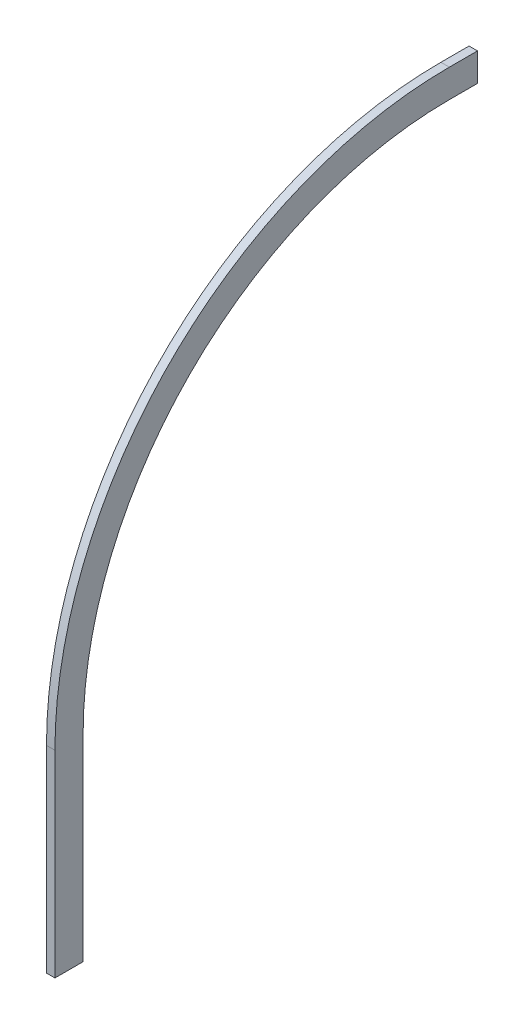
ISO-10303-21;
HEADER;
FILE_DESCRIPTION(('STEP AP214'),'2;1');
FILE_NAME('part.step','',(''),(''),'','','');
FILE_SCHEMA(('AUTOMOTIVE_DESIGN { 1 0 10303 214 1 1 1 1 }'));
ENDSEC;
DATA;
#1=APPLICATION_CONTEXT('core data for automotive mechanical design processes');
#2=APPLICATION_PROTOCOL_DEFINITION('international standard','automotive_design',2000,#1);
#3=PRODUCT_CONTEXT('',#1,'mechanical');
#4=PRODUCT('Part','Part','',(#3));
#5=PRODUCT_RELATED_PRODUCT_CATEGORY('part','',(#4));
#6=PRODUCT_DEFINITION_FORMATION('','',#4);
#7=PRODUCT_DEFINITION_CONTEXT('part definition',#1,'design');
#8=PRODUCT_DEFINITION('design','',#6,#7);
#9=PRODUCT_DEFINITION_SHAPE('','',#8);
#10=(LENGTH_UNIT() NAMED_UNIT(*) SI_UNIT(.MILLI.,.METRE.));
#11=(NAMED_UNIT(*) PLANE_ANGLE_UNIT() SI_UNIT($,.RADIAN.));
#12=(NAMED_UNIT(*) SI_UNIT($,.STERADIAN.) SOLID_ANGLE_UNIT());
#13=UNCERTAINTY_MEASURE_WITH_UNIT(LENGTH_MEASURE(1.E-05),#10,'distance_accuracy_value','');
#14=(GEOMETRIC_REPRESENTATION_CONTEXT(3) GLOBAL_UNCERTAINTY_ASSIGNED_CONTEXT((#13)) GLOBAL_UNIT_ASSIGNED_CONTEXT((#10,
#11,#12)) REPRESENTATION_CONTEXT('',''));
#15=CARTESIAN_POINT('',(0.,0.,0.));
#16=DIRECTION('',(0.,0.,1.));
#17=DIRECTION('',(1.,0.,0.));
#18=AXIS2_PLACEMENT_3D('',#15,#16,#17);
#19=CARTESIAN_POINT('',(3.,0.,0.));
#20=DIRECTION('',(0.,1.,0.));
#21=DIRECTION('',(0.,0.,1.));
#22=AXIS2_PLACEMENT_3D('',#19,#20,#21);
#23=PLANE('',#22);
#24=DIRECTION('',(0.,0.,-1.));
#25=VECTOR('',#24,1.);
#26=CARTESIAN_POINT('',(0.,0.,0.));
#27=LINE('',#26,#25);
#28=CARTESIAN_POINT('',(0.,0.,10.));
#29=VERTEX_POINT('',#28);
#30=CARTESIAN_POINT('',(0.,0.,0.));
#31=VERTEX_POINT('',#30);
#32=EDGE_CURVE('E134',#29,#31,#27,.T.);
#33=ORIENTED_EDGE('',*,*,#32,.T.);
#34=DIRECTION('',(-1.,0.,0.));
#35=VECTOR('',#34,1.);
#36=CARTESIAN_POINT('',(3.,0.,0.));
#37=LINE('',#36,#35);
#38=CARTESIAN_POINT('',(3.,0.,0.));
#39=VERTEX_POINT('',#38);
#40=EDGE_CURVE('E11',#39,#31,#37,.T.);
#41=ORIENTED_EDGE('',*,*,#40,.F.);
#42=DIRECTION('',(0.,0.,-1.));
#43=VECTOR('',#42,1.);
#44=CARTESIAN_POINT('',(3.,0.,0.));
#45=LINE('',#44,#43);
#46=CARTESIAN_POINT('',(3.,0.,10.));
#47=VERTEX_POINT('',#46);
#48=EDGE_CURVE('E148',#47,#39,#45,.T.);
#49=ORIENTED_EDGE('',*,*,#48,.F.);
#50=DIRECTION('',(-1.,0.,0.));
#51=VECTOR('',#50,1.);
#52=CARTESIAN_POINT('',(3.,0.,10.));
#53=LINE('',#52,#51);
#54=EDGE_CURVE('E130',#47,#29,#53,.T.);
#55=ORIENTED_EDGE('',*,*,#54,.T.);
#56=EDGE_LOOP('',(#33,#41,#49,#55));
#57=FACE_BOUND('',#56,.T.);
#58=ADVANCED_FACE('F38',(#57),#23,.F.);
#59=CARTESIAN_POINT('',(3.,0.,0.));
#60=DIRECTION('',(0.,0.,1.));
#61=DIRECTION('',(0.,-1.,0.));
#62=AXIS2_PLACEMENT_3D('',#59,#60,#61);
#63=PLANE('',#62);
#64=DIRECTION('',(0.,1.,0.));
#65=VECTOR('',#64,1.);
#66=CARTESIAN_POINT('',(0.,0.,0.));
#67=LINE('',#66,#65);
#68=CARTESIAN_POINT('',(0.,69.9999999999991,0.));
#69=VERTEX_POINT('',#68);
#70=EDGE_CURVE('E137',#31,#69,#67,.T.);
#71=ORIENTED_EDGE('',*,*,#70,.T.);
#72=DIRECTION('',(-1.,0.,0.));
#73=VECTOR('',#72,1.);
#74=CARTESIAN_POINT('',(3.,69.9999999999991,0.));
#75=LINE('',#74,#73);
#76=CARTESIAN_POINT('',(3.,69.9999999999991,0.));
#77=VERTEX_POINT('',#76);
#78=EDGE_CURVE('E46',#77,#69,#75,.T.);
#79=ORIENTED_EDGE('',*,*,#78,.F.);
#80=DIRECTION('',(0.,1.,0.));
#81=VECTOR('',#80,1.);
#82=CARTESIAN_POINT('',(3.,0.,0.));
#83=LINE('',#82,#81);
#84=EDGE_CURVE('E97',#39,#77,#83,.T.);
#85=ORIENTED_EDGE('',*,*,#84,.F.);
#86=ORIENTED_EDGE('',*,*,#40,.T.);
#87=EDGE_LOOP('',(#71,#79,#85,#86));
#88=FACE_BOUND('',#87,.T.);
#89=ADVANCED_FACE('F183',(#88),#63,.F.);
#90=CARTESIAN_POINT('',(3.,70.0000000000001,-130.));
#91=DIRECTION('',(-1.,0.,0.));
#92=DIRECTION('',(0.,0.,1.));
#93=AXIS2_PLACEMENT_3D('',#90,#91,#92);
#94=CYLINDRICAL_SURFACE('',#93,130.);
#95=CARTESIAN_POINT('',(0.,70.0000000000001,-130.));
#96=DIRECTION('',(-1.,0.,0.));
#97=DIRECTION('',(0.,0.,-1.));
#98=AXIS2_PLACEMENT_3D('',#95,#96,#97);
#99=CIRCLE('',#98,130.);
#100=CARTESIAN_POINT('',(0.,200.,-130.000000000001));
#101=VERTEX_POINT('',#100);
#102=EDGE_CURVE('E139',#69,#101,#99,.T.);
#103=ORIENTED_EDGE('',*,*,#102,.T.);
#104=DIRECTION('',(-1.,0.,0.));
#105=VECTOR('',#104,1.);
#106=CARTESIAN_POINT('',(3.,200.,-130.000000000001));
#107=LINE('',#106,#105);
#108=CARTESIAN_POINT('',(3.,200.,-130.000000000001));
#109=VERTEX_POINT('',#108);
#110=EDGE_CURVE('E155',#109,#101,#107,.T.);
#111=ORIENTED_EDGE('',*,*,#110,.F.);
#112=CARTESIAN_POINT('',(3.,70.0000000000001,-130.));
#113=DIRECTION('',(-1.,0.,0.));
#114=DIRECTION('',(0.,0.,-1.));
#115=AXIS2_PLACEMENT_3D('',#112,#113,#114);
#116=CIRCLE('',#115,130.);
#117=EDGE_CURVE('E163',#77,#109,#116,.T.);
#118=ORIENTED_EDGE('',*,*,#117,.F.);
#119=ORIENTED_EDGE('',*,*,#78,.T.);
#120=EDGE_LOOP('',(#103,#111,#118,#119));
#121=FACE_BOUND('',#120,.T.);
#122=ADVANCED_FACE('F161',(#121),#94,.F.);
#123=CARTESIAN_POINT('',(3.,200.,-130.000000000001));
#124=DIRECTION('',(0.,1.,0.));
#125=DIRECTION('',(0.,0.,1.));
#126=AXIS2_PLACEMENT_3D('',#123,#124,#125);
#127=PLANE('',#126);
#128=DIRECTION('',(0.,0.,-1.));
#129=VECTOR('',#128,1.);
#130=CARTESIAN_POINT('',(0.,200.,-130.000000000001));
#131=LINE('',#130,#129);
#132=CARTESIAN_POINT('',(0.,200.,-140.));
#133=VERTEX_POINT('',#132);
#134=EDGE_CURVE('E141',#101,#133,#131,.T.);
#135=ORIENTED_EDGE('',*,*,#134,.T.);
#136=DIRECTION('',(-1.,0.,0.));
#137=VECTOR('',#136,1.);
#138=CARTESIAN_POINT('',(3.,200.,-140.));
#139=LINE('',#138,#137);
#140=CARTESIAN_POINT('',(3.,200.,-140.));
#141=VERTEX_POINT('',#140);
#142=EDGE_CURVE('E152',#141,#133,#139,.T.);
#143=ORIENTED_EDGE('',*,*,#142,.F.);
#144=DIRECTION('',(0.,0.,-1.));
#145=VECTOR('',#144,1.);
#146=CARTESIAN_POINT('',(3.,200.,-130.000000000001));
#147=LINE('',#146,#145);
#148=EDGE_CURVE('E175',#109,#141,#147,.T.);
#149=ORIENTED_EDGE('',*,*,#148,.F.);
#150=ORIENTED_EDGE('',*,*,#110,.T.);
#151=EDGE_LOOP('',(#135,#143,#149,#150));
#152=FACE_BOUND('',#151,.T.);
#153=ADVANCED_FACE('F171',(#152),#127,.F.);
#154=CARTESIAN_POINT('',(3.,210.,-140.));
#155=DIRECTION('',(0.,0.,1.));
#156=DIRECTION('',(1.,0.,0.));
#157=AXIS2_PLACEMENT_3D('',#154,#155,#156);
#158=PLANE('',#157);
#159=DIRECTION('',(0.,1.,0.));
#160=VECTOR('',#159,1.);
#161=CARTESIAN_POINT('',(0.,210.,-140.));
#162=LINE('',#161,#160);
#163=CARTESIAN_POINT('',(0.,210.,-140.));
#164=VERTEX_POINT('',#163);
#165=EDGE_CURVE('E143',#133,#164,#162,.T.);
#166=ORIENTED_EDGE('',*,*,#165,.T.);
#167=DIRECTION('',(-1.,0.,0.));
#168=VECTOR('',#167,1.);
#169=CARTESIAN_POINT('',(3.,210.,-140.));
#170=LINE('',#169,#168);
#171=CARTESIAN_POINT('',(3.,210.,-140.));
#172=VERTEX_POINT('',#171);
#173=EDGE_CURVE('E125',#172,#164,#170,.T.);
#174=ORIENTED_EDGE('',*,*,#173,.F.);
#175=DIRECTION('',(0.,1.,0.));
#176=VECTOR('',#175,1.);
#177=CARTESIAN_POINT('',(3.,210.,-140.));
#178=LINE('',#177,#176);
#179=EDGE_CURVE('E116',#141,#172,#178,.T.);
#180=ORIENTED_EDGE('',*,*,#179,.F.);
#181=ORIENTED_EDGE('',*,*,#142,.T.);
#182=EDGE_LOOP('',(#166,#174,#180,#181));
#183=FACE_BOUND('',#182,.T.);
#184=ADVANCED_FACE('F174',(#183),#158,.F.);
#185=CARTESIAN_POINT('',(3.,210.,-130.000000000001));
#186=DIRECTION('',(0.,-1.,0.));
#187=DIRECTION('',(0.,0.,-1.));
#188=AXIS2_PLACEMENT_3D('',#185,#186,#187);
#189=PLANE('',#188);
#190=DIRECTION('',(0.,0.,1.));
#191=VECTOR('',#190,1.);
#192=CARTESIAN_POINT('',(0.,210.,-130.000000000001));
#193=LINE('',#192,#191);
#194=CARTESIAN_POINT('',(0.,210.,-130.000000000001));
#195=VERTEX_POINT('',#194);
#196=EDGE_CURVE('E124',#164,#195,#193,.T.);
#197=ORIENTED_EDGE('',*,*,#196,.T.);
#198=DIRECTION('',(-1.,0.,0.));
#199=VECTOR('',#198,1.);
#200=CARTESIAN_POINT('',(3.,210.,-130.000000000001));
#201=LINE('',#200,#199);
#202=CARTESIAN_POINT('',(3.,210.,-130.000000000001));
#203=VERTEX_POINT('',#202);
#204=EDGE_CURVE('E121',#203,#195,#201,.T.);
#205=ORIENTED_EDGE('',*,*,#204,.F.);
#206=DIRECTION('',(0.,0.,1.));
#207=VECTOR('',#206,1.);
#208=CARTESIAN_POINT('',(3.,210.,-130.000000000001));
#209=LINE('',#208,#207);
#210=EDGE_CURVE('E110',#172,#203,#209,.T.);
#211=ORIENTED_EDGE('',*,*,#210,.F.);
#212=ORIENTED_EDGE('',*,*,#173,.T.);
#213=EDGE_LOOP('',(#197,#205,#211,#212));
#214=FACE_BOUND('',#213,.T.);
#215=ADVANCED_FACE('F122',(#214),#189,.F.);
#216=CARTESIAN_POINT('',(3.,70.0000000000001,-130.));
#217=DIRECTION('',(-1.,0.,0.));
#218=DIRECTION('',(0.,0.,1.));
#219=AXIS2_PLACEMENT_3D('',#216,#217,#218);
#220=CYLINDRICAL_SURFACE('',#219,140.);
#221=CARTESIAN_POINT('',(0.,70.0000000000001,-130.));
#222=DIRECTION('',(1.,0.,0.));
#223=DIRECTION('',(0.,0.,-1.));
#224=AXIS2_PLACEMENT_3D('',#221,#222,#223);
#225=CIRCLE('',#224,140.);
#226=CARTESIAN_POINT('',(0.,69.9999999999991,10.));
#227=VERTEX_POINT('',#226);
#228=EDGE_CURVE('E83',#195,#227,#225,.T.);
#229=ORIENTED_EDGE('',*,*,#228,.T.);
#230=DIRECTION('',(-1.,0.,0.));
#231=VECTOR('',#230,1.);
#232=CARTESIAN_POINT('',(3.,69.9999999999991,10.));
#233=LINE('',#232,#231);
#234=CARTESIAN_POINT('',(3.,69.9999999999991,10.));
#235=VERTEX_POINT('',#234);
#236=EDGE_CURVE('E126',#235,#227,#233,.T.);
#237=ORIENTED_EDGE('',*,*,#236,.F.);
#238=CARTESIAN_POINT('',(3.,70.0000000000001,-130.));
#239=DIRECTION('',(1.,0.,0.));
#240=DIRECTION('',(0.,0.,-1.));
#241=AXIS2_PLACEMENT_3D('',#238,#239,#240);
#242=CIRCLE('',#241,140.);
#243=EDGE_CURVE('E114',#203,#235,#242,.T.);
#244=ORIENTED_EDGE('',*,*,#243,.F.);
#245=ORIENTED_EDGE('',*,*,#204,.T.);
#246=EDGE_LOOP('',(#229,#237,#244,#245));
#247=FACE_BOUND('',#246,.T.);
#248=ADVANCED_FACE('F128',(#247),#220,.T.);
#249=CARTESIAN_POINT('',(3.,0.,10.));
#250=DIRECTION('',(0.,0.,-1.));
#251=DIRECTION('',(-1.,0.,0.));
#252=AXIS2_PLACEMENT_3D('',#249,#250,#251);
#253=PLANE('',#252);
#254=DIRECTION('',(0.,-1.,0.));
#255=VECTOR('',#254,1.);
#256=CARTESIAN_POINT('',(0.,0.,10.));
#257=LINE('',#256,#255);
#258=EDGE_CURVE('E89',#227,#29,#257,.T.);
#259=ORIENTED_EDGE('',*,*,#258,.T.);
#260=ORIENTED_EDGE('',*,*,#54,.F.);
#261=DIRECTION('',(0.,-1.,0.));
#262=VECTOR('',#261,1.);
#263=CARTESIAN_POINT('',(3.,0.,10.));
#264=LINE('',#263,#262);
#265=EDGE_CURVE('E54',#235,#47,#264,.T.);
#266=ORIENTED_EDGE('',*,*,#265,.F.);
#267=ORIENTED_EDGE('',*,*,#236,.T.);
#268=EDGE_LOOP('',(#259,#260,#266,#267));
#269=FACE_BOUND('',#268,.T.);
#270=ADVANCED_FACE('F199',(#269),#253,.F.);
#271=CARTESIAN_POINT('',(3.,70.0000000000001,-130.));
#272=DIRECTION('',(1.,0.,0.));
#273=DIRECTION('',(0.,0.,-1.));
#274=AXIS2_PLACEMENT_3D('',#271,#272,#273);
#275=PLANE('',#274);
#276=ORIENTED_EDGE('',*,*,#48,.T.);
#277=ORIENTED_EDGE('',*,*,#84,.T.);
#278=ORIENTED_EDGE('',*,*,#117,.T.);
#279=ORIENTED_EDGE('',*,*,#148,.T.);
#280=ORIENTED_EDGE('',*,*,#179,.T.);
#281=ORIENTED_EDGE('',*,*,#210,.T.);
#282=ORIENTED_EDGE('',*,*,#243,.T.);
#283=ORIENTED_EDGE('',*,*,#265,.T.);
#284=EDGE_LOOP('',(#276,#277,#278,#279,#280,#281,#282,#283));
#285=FACE_BOUND('',#284,.T.);
#286=ADVANCED_FACE('F112',(#285),#275,.T.);
#287=CARTESIAN_POINT('',(0.,70.0000000000001,-130.));
#288=DIRECTION('',(1.,0.,0.));
#289=DIRECTION('',(0.,0.,-1.));
#290=AXIS2_PLACEMENT_3D('',#287,#288,#289);
#291=PLANE('',#290);
#292=ORIENTED_EDGE('',*,*,#32,.F.);
#293=ORIENTED_EDGE('',*,*,#258,.F.);
#294=ORIENTED_EDGE('',*,*,#228,.F.);
#295=ORIENTED_EDGE('',*,*,#196,.F.);
#296=ORIENTED_EDGE('',*,*,#165,.F.);
#297=ORIENTED_EDGE('',*,*,#134,.F.);
#298=ORIENTED_EDGE('',*,*,#102,.F.);
#299=ORIENTED_EDGE('',*,*,#70,.F.);
#300=EDGE_LOOP('',(#292,#293,#294,#295,#296,#297,#298,#299));
#301=FACE_BOUND('',#300,.T.);
#302=ADVANCED_FACE('F167',(#301),#291,.F.);
#303=CLOSED_SHELL('',(#58,#89,#122,#153,#184,#215,#248,#270,#286,#302));
#304=MANIFOLD_SOLID_BREP('B2',#303);
#305=ADVANCED_BREP_SHAPE_REPRESENTATION('',(#18,#304),#14);
#306=SHAPE_DEFINITION_REPRESENTATION(#9,#305);
ENDSEC;
END-ISO-10303-21;
